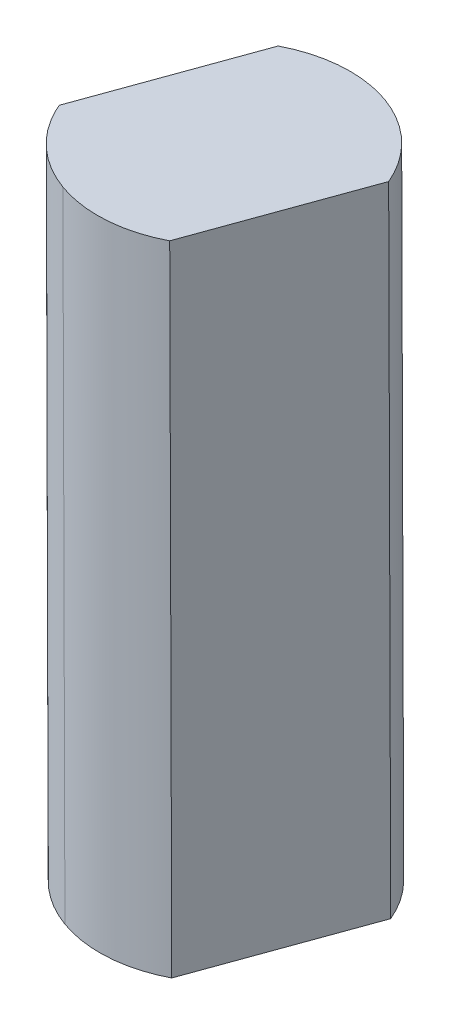
ISO-10303-21;
HEADER;
FILE_DESCRIPTION(('STEP AP214'),'2;1');
FILE_NAME('part.step','',(''),(''),'','','');
FILE_SCHEMA(('AUTOMOTIVE_DESIGN { 1 0 10303 214 1 1 1 1 }'));
ENDSEC;
DATA;
#1=APPLICATION_CONTEXT('core data for automotive mechanical design processes');
#2=APPLICATION_PROTOCOL_DEFINITION('international standard','automotive_design',2000,#1);
#3=PRODUCT_CONTEXT('',#1,'mechanical');
#4=PRODUCT('Part','Part','',(#3));
#5=PRODUCT_RELATED_PRODUCT_CATEGORY('part','',(#4));
#6=PRODUCT_DEFINITION_FORMATION('','',#4);
#7=PRODUCT_DEFINITION_CONTEXT('part definition',#1,'design');
#8=PRODUCT_DEFINITION('design','',#6,#7);
#9=PRODUCT_DEFINITION_SHAPE('','',#8);
#10=(LENGTH_UNIT() NAMED_UNIT(*) SI_UNIT(.MILLI.,.METRE.));
#11=(NAMED_UNIT(*) PLANE_ANGLE_UNIT() SI_UNIT($,.RADIAN.));
#12=(NAMED_UNIT(*) SI_UNIT($,.STERADIAN.) SOLID_ANGLE_UNIT());
#13=UNCERTAINTY_MEASURE_WITH_UNIT(LENGTH_MEASURE(1.E-05),#10,'distance_accuracy_value','');
#14=(GEOMETRIC_REPRESENTATION_CONTEXT(3) GLOBAL_UNCERTAINTY_ASSIGNED_CONTEXT((#13)) GLOBAL_UNIT_ASSIGNED_CONTEXT((#10,
#11,#12)) REPRESENTATION_CONTEXT('',''));
#15=CARTESIAN_POINT('',(0.,0.,0.));
#16=DIRECTION('',(0.,0.,1.));
#17=DIRECTION('',(1.,0.,0.));
#18=AXIS2_PLACEMENT_3D('',#15,#16,#17);
#19=CARTESIAN_POINT('',(209.312798664452,126.670889308879,-173.403313789461));
#20=DIRECTION('',(0.940180277421394,0.00391507184373613,0.340654837277103));
#21=DIRECTION('',(-0.340654989152333,-0.000648546411341044,0.940188150187597));
#22=AXIS2_PLACEMENT_3D('',#19,#20,#21);
#23=PLANE('',#22);
#24=DIRECTION('',(-0.340654989152249,-0.000648546411340679,0.940188150187628));
#25=VECTOR('',#24,1.);
#26=CARTESIAN_POINT('',(208.67847452611,111.169688579099,-171.474477658118));
#27=LINE('',#26,#25);
#28=CARTESIAN_POINT('',(209.373277101021,111.171011359378,-173.392092747276));
#29=VERTEX_POINT('',#28);
#30=CARTESIAN_POINT('',(207.983671951199,111.16836579882,-169.55686256896));
#31=VERTEX_POINT('',#30);
#32=EDGE_CURVE('E131',#29,#31,#27,.T.);
#33=ORIENTED_EDGE('',*,*,#32,.F.);
#34=DIRECTION('',(0.00390183462676693,-0.999992125769004,0.000723938211519815));
#35=VECTOR('',#34,1.);
#36=CARTESIAN_POINT('',(209.343623158159,118.770951514812,-173.397594678253));
#37=LINE('',#36,#35);
#38=CARTESIAN_POINT('',(209.313969214307,126.370891670658,-173.403096608226));
#39=VERTEX_POINT('',#38);
#40=EDGE_CURVE('E36',#39,#29,#37,.T.);
#41=ORIENTED_EDGE('',*,*,#40,.F.);
#42=DIRECTION('',(-0.340654989152249,-0.000648546411340679,0.940188150187628));
#43=VECTOR('',#42,1.);
#44=CARTESIAN_POINT('',(208.619166639387,126.36956888988,-171.485481519072));
#45=LINE('',#44,#43);
#46=CARTESIAN_POINT('',(207.924364065485,126.368246110084,-169.567866429912));
#47=VERTEX_POINT('',#46);
#48=EDGE_CURVE('E11',#39,#47,#45,.T.);
#49=ORIENTED_EDGE('',*,*,#48,.T.);
#50=DIRECTION('',(0.00390183462676693,-0.999992125769004,0.000723938211519815));
#51=VECTOR('',#50,1.);
#52=CARTESIAN_POINT('',(207.954018008339,118.76830595425,-169.562364498937));
#53=LINE('',#52,#51);
#54=EDGE_CURVE('E27',#47,#31,#53,.T.);
#55=ORIENTED_EDGE('',*,*,#54,.T.);
#56=EDGE_LOOP('',(#33,#41,#49,#55));
#57=FACE_BOUND('',#56,.T.);
#58=ADVANCED_FACE('F17',(#57),#23,.T.);
#59=CARTESIAN_POINT('',(206.610077916238,111.161075421019,-172.223918300111));
#60=DIRECTION('',(0.00390183462676693,-0.999992125769004,0.000723938211519815));
#61=DIRECTION('',(-0.940180277421394,-0.00391507184367015,-0.340654837277104));
#62=AXIS2_PLACEMENT_3D('',#59,#60,#61);
#63=PLANE('',#62);
#64=ORIENTED_EDGE('',*,*,#32,.T.);
#65=CARTESIAN_POINT('',(206.610077915238,111.161075421036,-172.223918300109));
#66=DIRECTION('',(0.00390183462676693,-0.999992125769004,0.000723938211519815));
#67=DIRECTION('',(-0.999991428626323,-0.00390082715659853,0.00138788377779717));
#68=AXIS2_PLACEMENT_3D('',#65,#66,#67);
#69=CIRCLE('',#68,2.99999999977);
#70=CARTESIAN_POINT('',(205.588112948524,111.159129781815,-169.403353849815));
#71=VERTEX_POINT('',#70);
#72=EDGE_CURVE('E129',#31,#71,#69,.T.);
#73=ORIENTED_EDGE('',*,*,#72,.T.);
#74=CARTESIAN_POINT('',(206.610077915238,111.161075421036,-172.223918300109));
#75=DIRECTION('',(0.00390183462676693,-0.999992125769004,0.000723938211519815));
#76=DIRECTION('',(-0.999991428626323,-0.00390082715659853,0.00138788377779717));
#77=AXIS2_PLACEMENT_3D('',#74,#75,#76);
#78=CIRCLE('',#77,2.99999999977);
#79=CARTESIAN_POINT('',(203.846878730456,111.151139482672,-171.055743851945));
#80=VERTEX_POINT('',#79);
#81=EDGE_CURVE('E90',#71,#80,#78,.T.);
#82=ORIENTED_EDGE('',*,*,#81,.T.);
#83=DIRECTION('',(0.340654989152249,0.000648546411340679,-0.940188150187628));
#84=VECTOR('',#83,1.);
#85=CARTESIAN_POINT('',(204.541681306365,111.152462262939,-172.973358942103));
#86=LINE('',#85,#84);
#87=CARTESIAN_POINT('',(205.236483880278,111.153785043335,-174.89097403126));
#88=VERTEX_POINT('',#87);
#89=EDGE_CURVE('E125',#80,#88,#86,.T.);
#90=ORIENTED_EDGE('',*,*,#89,.T.);
#91=CARTESIAN_POINT('',(206.610077916238,111.161075421019,-172.223918300111));
#92=DIRECTION('',(0.00390183462676693,-0.999992125769004,0.000723938211519815));
#93=DIRECTION('',(-0.999991428626323,-0.00390082715659853,0.00138788377779717));
#94=AXIS2_PLACEMENT_3D('',#91,#92,#93);
#95=CIRCLE('',#94,2.99999999977);
#96=CARTESIAN_POINT('',(207.632042882952,111.163021060241,-175.044482750405));
#97=VERTEX_POINT('',#96);
#98=EDGE_CURVE('E122',#88,#97,#95,.T.);
#99=ORIENTED_EDGE('',*,*,#98,.T.);
#100=CARTESIAN_POINT('',(206.610077916238,111.161075421019,-172.223918300111));
#101=DIRECTION('',(0.00390183462676693,-0.999992125769004,0.000723938211519815));
#102=DIRECTION('',(-0.999991428626323,-0.00390082715659853,0.00138788377779717));
#103=AXIS2_PLACEMENT_3D('',#100,#101,#102);
#104=CIRCLE('',#103,2.99999999977);
#105=EDGE_CURVE('E119',#97,#29,#104,.T.);
#106=ORIENTED_EDGE('',*,*,#105,.T.);
#107=EDGE_LOOP('',(#64,#73,#82,#90,#99,#106));
#108=FACE_BOUND('',#107,.T.);
#109=ADVANCED_FACE('F134',(#108),#63,.T.);
#110=CARTESIAN_POINT('',(206.549599478671,126.660953370637,-172.235139342294));
#111=DIRECTION('',(0.00390183462676693,-0.999992125769004,0.000723938211519815));
#112=DIRECTION('',(0.999991587813048,0.0039009147543635,-0.00126774098998158));
#113=AXIS2_PLACEMENT_3D('',#110,#111,#112);
#114=CYLINDRICAL_SURFACE('',#113,3.);
#115=DIRECTION('',(-0.00390183462676693,0.999992125769004,-0.000723938211519815));
#116=VECTOR('',#115,1.);
#117=CARTESIAN_POINT('',(207.571564446368,126.662899008841,-175.055703792595));
#118=LINE('',#117,#116);
#119=CARTESIAN_POINT('',(207.572734997238,126.362901371604,-175.055486611357));
#120=VERTEX_POINT('',#119);
#121=EDGE_CURVE('E116',#97,#120,#118,.T.);
#122=ORIENTED_EDGE('',*,*,#121,.T.);
#123=CARTESIAN_POINT('',(206.550770029525,126.360955732399,-172.234922161061));
#124=DIRECTION('',(0.00390183462676693,-0.999992125769004,0.000723938211519815));
#125=DIRECTION('',(-0.999991428626323,-0.00390082715659852,0.00138788377780178));
#126=AXIS2_PLACEMENT_3D('',#123,#124,#125);
#127=CIRCLE('',#126,3.);
#128=EDGE_CURVE('E93',#120,#39,#127,.T.);
#129=ORIENTED_EDGE('',*,*,#128,.T.);
#130=ORIENTED_EDGE('',*,*,#40,.T.);
#131=ORIENTED_EDGE('',*,*,#105,.F.);
#132=EDGE_LOOP('',(#122,#129,#130,#131));
#133=FACE_BOUND('',#132,.T.);
#134=ADVANCED_FACE('F136',(#133),#114,.T.);
#135=CARTESIAN_POINT('',(206.550770029525,126.360955732399,-172.234922161061));
#136=DIRECTION('',(-0.00390183462676693,0.999992125769004,-0.000723938211519815));
#137=DIRECTION('',(0.940180277421394,0.00391507184367015,0.340654837277104));
#138=AXIS2_PLACEMENT_3D('',#135,#136,#137);
#139=PLANE('',#138);
#140=ORIENTED_EDGE('',*,*,#48,.F.);
#141=ORIENTED_EDGE('',*,*,#128,.F.);
#142=CARTESIAN_POINT('',(205.177175994564,126.353665354703,-174.901977893211));
#143=CARTESIAN_POINT('',(205.478911626437,126.35473018291,-175.057381479174));
#144=CARTESIAN_POINT('',(205.802623457423,126.355911651717,-175.170113470714));
#145=CARTESIAN_POINT('',(206.14030053311,126.357181507983,-175.236021766052));
#146=CARTESIAN_POINT('',(206.638497255395,126.359107211678,-175.261152391059));
#147=CARTESIAN_POINT('',(207.127547790239,126.361070516543,-175.185047222569));
#148=CARTESIAN_POINT('',(207.278795220178,126.361685018062,-175.151406188715));
#149=CARTESIAN_POINT('',(207.427458576819,126.362296419079,-175.108120982896));
#150=CARTESIAN_POINT('',(207.572733742774,126.362901369558,-175.055483149705));
#151=B_SPLINE_CURVE_WITH_KNOTS('',5,(#142,#143,#144,#145,#146,#147,#148,#149,#150),
.UNSPECIFIED.,.F.,.F.,(6,3,6),(0.,0.687168159581133,1.),.UNSPECIFIED.);
#152=CARTESIAN_POINT('',(205.177175993565,126.353665354715,-174.90197789221));
#153=VERTEX_POINT('',#152);
#154=EDGE_CURVE('E101',#153,#120,#151,.T.);
#155=ORIENTED_EDGE('',*,*,#154,.F.);
#156=DIRECTION('',(0.340654989152249,0.000648546411340679,-0.940188150187628));
#157=VECTOR('',#156,1.);
#158=CARTESIAN_POINT('',(204.482373419664,126.352342574914,-172.984362802051));
#159=LINE('',#158,#157);
#160=CARTESIAN_POINT('',(203.787570844728,126.351019793136,-171.0667477129));
#161=VERTEX_POINT('',#160);
#162=EDGE_CURVE('E67',#161,#153,#159,.T.);
#163=ORIENTED_EDGE('',*,*,#162,.F.);
#164=CARTESIAN_POINT('',(205.528806316294,126.35901009624,-169.414361172411));
#165=CARTESIAN_POINT('',(205.35496924599,126.358286208274,-169.477347895941));
#166=CARTESIAN_POINT('',(205.185983605906,126.357571554834,-169.553726319968));
#167=CARTESIAN_POINT('',(205.02322715345,126.356871874822,-169.64299691756));
#168=CARTESIAN_POINT('',(204.608559118668,126.355057692434,-169.914017093859));
#169=CARTESIAN_POINT('',(204.255874176199,126.353427036462,-170.265600843788));
#170=CARTESIAN_POINT('',(204.064883412248,126.352502736308,-170.512967590647));
#171=CARTESIAN_POINT('',(203.90790199009,126.351695371167,-170.78211074186));
#172=CARTESIAN_POINT('',(203.787570844746,126.351019794131,-171.066747711896));
#173=B_SPLINE_CURVE_WITH_KNOTS('',5,(#164,#165,#166,#167,#168,#169,#170,#171,#172),
.UNSPECIFIED.,.F.,.F.,(6,3,6),(0.,0.374335532140163,1.),.UNSPECIFIED.);
#174=CARTESIAN_POINT('',(205.528805061813,126.35901009319,-169.414357709765));
#175=VERTEX_POINT('',#174);
#176=EDGE_CURVE('E70',#175,#161,#173,.T.);
#177=ORIENTED_EDGE('',*,*,#176,.F.);
#178=CARTESIAN_POINT('',(207.924364063486,126.368246110113,-169.56786642891));
#179=CARTESIAN_POINT('',(207.622628432614,126.367181281883,-169.412462841948));
#180=CARTESIAN_POINT('',(207.298916601644,126.365999814077,-169.299730850402));
#181=CARTESIAN_POINT('',(206.961239525941,126.364729956811,-169.233822555071));
#182=CARTESIAN_POINT('',(206.463042803672,126.362804254116,-169.208691930058));
#183=CARTESIAN_POINT('',(205.973992268813,126.360840948251,-169.284797098554));
#184=CARTESIAN_POINT('',(205.82274483889,126.360226447732,-169.318438132402));
#185=CARTESIAN_POINT('',(205.674081482249,126.359615046715,-169.361723338222));
#186=CARTESIAN_POINT('',(205.528806316294,126.35901009624,-169.414361172411));
#187=B_SPLINE_CURVE_WITH_KNOTS('',5,(#178,#179,#180,#181,#182,#183,#184,#185,#186),
.UNSPECIFIED.,.F.,.F.,(6,3,6),(0.,0.687168159633185,1.),.UNSPECIFIED.);
#188=EDGE_CURVE('E74',#47,#175,#187,.T.);
#189=ORIENTED_EDGE('',*,*,#188,.F.);
#190=EDGE_LOOP('',(#140,#141,#155,#163,#177,#189));
#191=FACE_BOUND('',#190,.T.);
#192=ADVANCED_FACE('F73',(#191),#139,.T.);
#193=CARTESIAN_POINT('',(206.549599478671,126.660953370637,-172.235139342294));
#194=DIRECTION('',(0.00390183462676693,-0.999992125769004,0.000723938211519815));
#195=DIRECTION('',(0.999991587813048,0.0039009147543635,-0.00126774098998158));
#196=AXIS2_PLACEMENT_3D('',#193,#194,#195);
#197=CYLINDRICAL_SURFACE('',#196,3.);
#198=DIRECTION('',(0.00390183462676693,-0.999992125769004,0.000723938211519815));
#199=VECTOR('',#198,1.);
#200=CARTESIAN_POINT('',(205.527634511957,126.659007731415,-169.414574891999));
#201=LINE('',#200,#199);
#202=EDGE_CURVE('E85',#175,#71,#201,.T.);
#203=ORIENTED_EDGE('',*,*,#202,.T.);
#204=ORIENTED_EDGE('',*,*,#72,.F.);
#205=ORIENTED_EDGE('',*,*,#54,.F.);
#206=ORIENTED_EDGE('',*,*,#188,.T.);
#207=EDGE_LOOP('',(#203,#204,#205,#206));
#208=FACE_BOUND('',#207,.T.);
#209=ADVANCED_FACE('F83',(#208),#197,.T.);
#210=CARTESIAN_POINT('',(206.549599478671,126.660953370637,-172.235139342294));
#211=DIRECTION('',(0.00390183462676693,-0.999992125769004,0.000723938211519815));
#212=DIRECTION('',(0.999991587813048,0.0039009147543635,-0.00126774098998158));
#213=AXIS2_PLACEMENT_3D('',#210,#211,#212);
#214=CYLINDRICAL_SURFACE('',#213,3.);
#215=ORIENTED_EDGE('',*,*,#202,.F.);
#216=ORIENTED_EDGE('',*,*,#176,.T.);
#217=DIRECTION('',(0.00390183462676693,-0.999992125769004,0.000723938211519815));
#218=VECTOR('',#217,1.);
#219=CARTESIAN_POINT('',(203.786400293874,126.651017431373,-171.066964894133));
#220=LINE('',#219,#218);
#221=EDGE_CURVE('E79',#161,#80,#220,.T.);
#222=ORIENTED_EDGE('',*,*,#221,.T.);
#223=ORIENTED_EDGE('',*,*,#81,.F.);
#224=EDGE_LOOP('',(#215,#216,#222,#223));
#225=FACE_BOUND('',#224,.T.);
#226=ADVANCED_FACE('F88',(#225),#214,.T.);
#227=CARTESIAN_POINT('',(203.786400293891,126.651017432373,-171.066964894129));
#228=DIRECTION('',(-0.940180277421394,-0.00391507184373613,-0.340654837277103));
#229=DIRECTION('',(0.340654989152333,0.000648546411341044,-0.940188150187597));
#230=AXIS2_PLACEMENT_3D('',#227,#228,#229);
#231=PLANE('',#230);
#232=ORIENTED_EDGE('',*,*,#89,.F.);
#233=ORIENTED_EDGE('',*,*,#221,.F.);
#234=ORIENTED_EDGE('',*,*,#162,.T.);
#235=DIRECTION('',(0.00390183462676693,-0.999992125769004,0.000723938211519815));
#236=VECTOR('',#235,1.);
#237=CARTESIAN_POINT('',(205.20682993742,118.753725198864,-174.896475961236));
#238=LINE('',#237,#236);
#239=EDGE_CURVE('E21',#153,#88,#238,.T.);
#240=ORIENTED_EDGE('',*,*,#239,.T.);
#241=EDGE_LOOP('',(#232,#233,#234,#240));
#242=FACE_BOUND('',#241,.T.);
#243=ADVANCED_FACE('F139',(#242),#231,.T.);
#244=CARTESIAN_POINT('',(206.549599478671,126.660953370637,-172.235139342294));
#245=DIRECTION('',(0.00390183462676693,-0.999992125769004,0.000723938211519815));
#246=DIRECTION('',(0.999991587813048,0.0039009147543635,-0.00126774098998158));
#247=AXIS2_PLACEMENT_3D('',#244,#245,#246);
#248=CYLINDRICAL_SURFACE('',#247,3.);
#249=ORIENTED_EDGE('',*,*,#121,.F.);
#250=ORIENTED_EDGE('',*,*,#98,.F.);
#251=ORIENTED_EDGE('',*,*,#239,.F.);
#252=ORIENTED_EDGE('',*,*,#154,.T.);
#253=EDGE_LOOP('',(#249,#250,#251,#252));
#254=FACE_BOUND('',#253,.T.);
#255=ADVANCED_FACE('F19',(#254),#248,.T.);
#256=CLOSED_SHELL('',(#58,#109,#134,#192,#209,#226,#243,#255));
#257=MANIFOLD_SOLID_BREP('B1',#256);
#258=ADVANCED_BREP_SHAPE_REPRESENTATION('',(#18,#257),#14);
#259=SHAPE_DEFINITION_REPRESENTATION(#9,#258);
ENDSEC;
END-ISO-10303-21;
